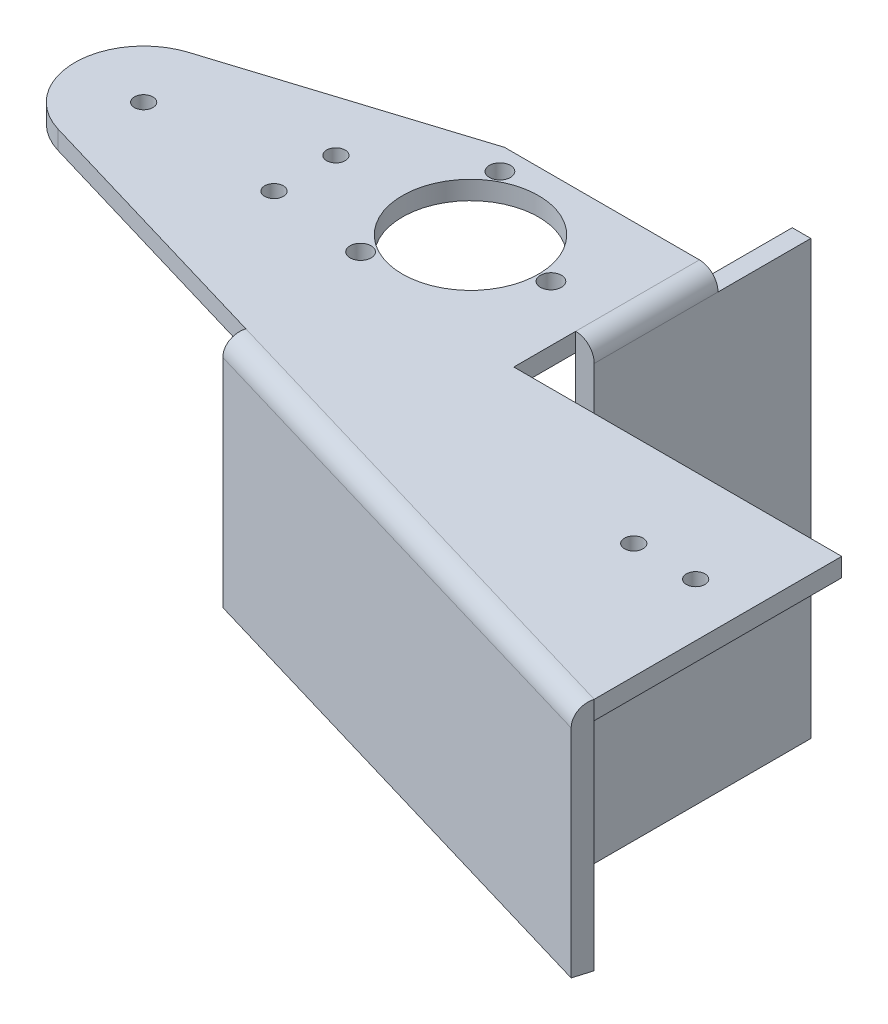
ISO-10303-21;
HEADER;
FILE_DESCRIPTION(('STEP AP214'),'2;1');
FILE_NAME('part.step','',(''),(''),'','','');
FILE_SCHEMA(('AUTOMOTIVE_DESIGN { 1 0 10303 214 1 1 1 1 }'));
ENDSEC;
DATA;
#1=APPLICATION_CONTEXT('core data for automotive mechanical design processes');
#2=APPLICATION_PROTOCOL_DEFINITION('international standard','automotive_design',2000,#1);
#3=PRODUCT_CONTEXT('',#1,'mechanical');
#4=PRODUCT('Part','Part','',(#3));
#5=PRODUCT_RELATED_PRODUCT_CATEGORY('part','',(#4));
#6=PRODUCT_DEFINITION_FORMATION('','',#4);
#7=PRODUCT_DEFINITION_CONTEXT('part definition',#1,'design');
#8=PRODUCT_DEFINITION('design','',#6,#7);
#9=PRODUCT_DEFINITION_SHAPE('','',#8);
#10=(LENGTH_UNIT() NAMED_UNIT(*) SI_UNIT(.MILLI.,.METRE.));
#11=(NAMED_UNIT(*) PLANE_ANGLE_UNIT() SI_UNIT($,.RADIAN.));
#12=(NAMED_UNIT(*) SI_UNIT($,.STERADIAN.) SOLID_ANGLE_UNIT());
#13=UNCERTAINTY_MEASURE_WITH_UNIT(LENGTH_MEASURE(1.E-05),#10,'distance_accuracy_value','');
#14=(GEOMETRIC_REPRESENTATION_CONTEXT(3) GLOBAL_UNCERTAINTY_ASSIGNED_CONTEXT((#13)) GLOBAL_UNIT_ASSIGNED_CONTEXT((#10,
#11,#12)) REPRESENTATION_CONTEXT('',''));
#15=CARTESIAN_POINT('',(0.,0.,0.));
#16=DIRECTION('',(0.,0.,1.));
#17=DIRECTION('',(1.,0.,0.));
#18=AXIS2_PLACEMENT_3D('',#15,#16,#17);
#19=CARTESIAN_POINT('',(-531.814143115865,-3.,33.209876935335));
#20=DIRECTION('',(0.,-1.,0.));
#21=DIRECTION('',(0.,0.,1.));
#22=AXIS2_PLACEMENT_3D('',#19,#20,#21);
#23=PLANE('',#22);
#24=CARTESIAN_POINT('',(-430.455543115792,-3.,55.359876935335));
#25=DIRECTION('',(0.,1.,0.));
#26=DIRECTION('',(0.,0.,1.));
#27=AXIS2_PLACEMENT_3D('',#24,#25,#26);
#28=CIRCLE('',#27,1.49999999998116);
#29=CARTESIAN_POINT('',(-430.455543115792,-3.,56.8598769353162));
#30=VERTEX_POINT('',#29);
#31=EDGE_CURVE('E200',#30,#30,#28,.T.);
#32=ORIENTED_EDGE('',*,*,#31,.T.);
#33=EDGE_LOOP('',(#32));
#34=FACE_BOUND('',#33,.T.);
#35=CARTESIAN_POINT('',(-493.344143115865,-3.,14.1015466861375));
#36=DIRECTION('',(0.,1.,0.));
#37=DIRECTION('',(0.,0.,1.));
#38=AXIS2_PLACEMENT_3D('',#35,#36,#37);
#39=CIRCLE('',#38,1.70000000000349);
#40=CARTESIAN_POINT('',(-493.344143115865,-3.,15.801546686141));
#41=VERTEX_POINT('',#40);
#42=EDGE_CURVE('E213',#41,#41,#39,.T.);
#43=ORIENTED_EDGE('',*,*,#42,.T.);
#44=EDGE_LOOP('',(#43));
#45=FACE_BOUND('',#44,.T.);
#46=CARTESIAN_POINT('',(-473.844143115865,-3.,25.3598769353352));
#47=DIRECTION('',(0.,1.,0.));
#48=DIRECTION('',(0.,0.,1.));
#49=AXIS2_PLACEMENT_3D('',#46,#47,#48);
#50=CIRCLE('',#49,1.70000000000361);
#51=CARTESIAN_POINT('',(-473.844143115865,-3.,27.0598769353388));
#52=VERTEX_POINT('',#51);
#53=EDGE_CURVE('E225',#52,#52,#50,.T.);
#54=ORIENTED_EDGE('',*,*,#53,.T.);
#55=EDGE_LOOP('',(#54));
#56=FACE_BOUND('',#55,.T.);
#57=CARTESIAN_POINT('',(-508.844143115865,-3.,25.113476935338));
#58=DIRECTION('',(0.,1.,0.));
#59=DIRECTION('',(0.,0.,1.));
#60=AXIS2_PLACEMENT_3D('',#57,#58,#59);
#61=CIRCLE('',#60,1.49999999999997);
#62=CARTESIAN_POINT('',(-508.844143115865,-3.,26.613476935338));
#63=VERTEX_POINT('',#62);
#64=EDGE_CURVE('E237',#63,#63,#61,.T.);
#65=ORIENTED_EDGE('',*,*,#64,.T.);
#66=EDGE_LOOP('',(#65));
#67=FACE_BOUND('',#66,.T.);
#68=CARTESIAN_POINT('',(-531.814143115865,-3.,33.209876935335));
#69=DIRECTION('',(0.,1.,0.));
#70=DIRECTION('',(0.,0.,1.));
#71=AXIS2_PLACEMENT_3D('',#68,#69,#70);
#72=CIRCLE('',#71,1.49999999999997);
#73=CARTESIAN_POINT('',(-531.814143115865,-3.,34.709876935335));
#74=VERTEX_POINT('',#73);
#75=EDGE_CURVE('E249',#74,#74,#72,.T.);
#76=ORIENTED_EDGE('',*,*,#75,.T.);
#77=EDGE_LOOP('',(#76));
#78=FACE_BOUND('',#77,.T.);
#79=CARTESIAN_POINT('',(-508.844143115865,-3.,35.113476935338));
#80=DIRECTION('',(0.,1.,0.));
#81=DIRECTION('',(0.,0.,1.));
#82=AXIS2_PLACEMENT_3D('',#79,#80,#81);
#83=CIRCLE('',#82,1.49999999999997);
#84=CARTESIAN_POINT('',(-508.844143115865,-3.,36.613476935338));
#85=VERTEX_POINT('',#84);
#86=EDGE_CURVE('E243',#85,#85,#83,.T.);
#87=ORIENTED_EDGE('',*,*,#86,.T.);
#88=EDGE_LOOP('',(#87));
#89=FACE_BOUND('',#88,.T.);
#90=CARTESIAN_POINT('',(-486.844143115865,-3.,25.359876935335));
#91=DIRECTION('',(0.,1.,0.));
#92=DIRECTION('',(0.,0.,1.));
#93=AXIS2_PLACEMENT_3D('',#90,#91,#92);
#94=CIRCLE('',#93,11.0000000000028);
#95=CARTESIAN_POINT('',(-486.844143115865,-3.,36.3598769353378));
#96=VERTEX_POINT('',#95);
#97=EDGE_CURVE('E231',#96,#96,#94,.T.);
#98=ORIENTED_EDGE('',*,*,#97,.T.);
#99=EDGE_LOOP('',(#98));
#100=FACE_BOUND('',#99,.T.);
#101=CARTESIAN_POINT('',(-493.344143115865,-3.,36.6182071845329));
#102=DIRECTION('',(0.,1.,0.));
#103=DIRECTION('',(0.,0.,1.));
#104=AXIS2_PLACEMENT_3D('',#101,#102,#103);
#105=CIRCLE('',#104,1.70000000000345);
#106=CARTESIAN_POINT('',(-493.344143115865,-3.,38.3182071845364));
#107=VERTEX_POINT('',#106);
#108=EDGE_CURVE('E219',#107,#107,#105,.T.);
#109=ORIENTED_EDGE('',*,*,#108,.T.);
#110=EDGE_LOOP('',(#109));
#111=FACE_BOUND('',#110,.T.);
#112=CARTESIAN_POINT('',(-420.455543115792,-3.,55.359876935335));
#113=DIRECTION('',(0.,1.,0.));
#114=DIRECTION('',(0.,0.,1.));
#115=AXIS2_PLACEMENT_3D('',#112,#113,#114);
#116=CIRCLE('',#115,1.49999999998116);
#117=CARTESIAN_POINT('',(-420.455543115792,-3.,56.8598769353162));
#118=VERTEX_POINT('',#117);
#119=EDGE_CURVE('E207',#118,#118,#116,.T.);
#120=ORIENTED_EDGE('',*,*,#119,.T.);
#121=EDGE_LOOP('',(#120));
#122=FACE_BOUND('',#121,.T.);
#123=DIRECTION('',(0.958808610714418,0.,0.284052896517335));
#124=VECTOR('',#123,1.);
#125=CARTESIAN_POINT('',(-534.975651854103,-3.,43.8814167725865));
#126=LINE('',#125,#124);
#127=CARTESIAN_POINT('',(-534.975651854103,-3.,43.8814167725865));
#128=VERTEX_POINT('',#127);
#129=CARTESIAN_POINT('',(-491.844143115865,-3.,56.6593891972715));
#130=VERTEX_POINT('',#129);
#131=EDGE_CURVE('E258',#128,#130,#126,.T.);
#132=ORIENTED_EDGE('',*,*,#131,.F.);
#133=CARTESIAN_POINT('',(-531.814143115865,-3.,33.209876935335));
#134=DIRECTION('',(0.,1.,0.));
#135=DIRECTION('',(0.,0.,1.));
#136=AXIS2_PLACEMENT_3D('',#133,#134,#135);
#137=CIRCLE('',#136,11.13);
#138=CARTESIAN_POINT('',(-535.160059098475,-3.,22.5947110752404));
#139=VERTEX_POINT('',#138);
#140=EDGE_CURVE('E255',#139,#128,#137,.T.);
#141=ORIENTED_EDGE('',*,*,#140,.F.);
#142=DIRECTION('',(-0.953743563350818,0.,0.300621382085313));
#143=VECTOR('',#142,1.);
#144=CARTESIAN_POINT('',(-496.344143115865,-3.,10.359876935335));
#145=LINE('',#144,#143);
#146=CARTESIAN_POINT('',(-496.344143115865,-3.,10.359876935335));
#147=VERTEX_POINT('',#146);
#148=EDGE_CURVE('E276',#147,#139,#145,.T.);
#149=ORIENTED_EDGE('',*,*,#148,.F.);
#150=DIRECTION('',(-1.,0.,0.));
#151=VECTOR('',#150,1.);
#152=CARTESIAN_POINT('',(-461.844143115865,-3.,10.359876935335));
#153=LINE('',#152,#151);
#154=CARTESIAN_POINT('',(-464.844143115865,-3.,10.359876935335));
#155=VERTEX_POINT('',#154);
#156=EDGE_CURVE('E271',#155,#147,#153,.T.);
#157=ORIENTED_EDGE('',*,*,#156,.F.);
#158=DIRECTION('',(0.,0.,1.));
#159=VECTOR('',#158,1.);
#160=CARTESIAN_POINT('',(-464.844143115865,-2.99999999997697,-4.64012306466499));
#161=LINE('',#160,#159);
#162=CARTESIAN_POINT('',(-464.844143115865,-2.99999999997735,30.359876935335));
#163=VERTEX_POINT('',#162);
#164=EDGE_CURVE('E191',#155,#163,#161,.T.);
#165=ORIENTED_EDGE('',*,*,#164,.T.);
#166=DIRECTION('',(0.,0.,-1.));
#167=VECTOR('',#166,1.);
#168=CARTESIAN_POINT('',(-464.844143115865,-3.,30.359876935335));
#169=LINE('',#168,#167);
#170=CARTESIAN_POINT('',(-464.844143115865,-3.,40.359876935335));
#171=VERTEX_POINT('',#170);
#172=EDGE_CURVE('E268',#171,#163,#169,.T.);
#173=ORIENTED_EDGE('',*,*,#172,.F.);
#174=DIRECTION('',(-1.,0.,0.));
#175=VECTOR('',#174,1.);
#176=CARTESIAN_POINT('',(-464.844143115865,-3.,40.359876935335));
#177=LINE('',#176,#175);
#178=CARTESIAN_POINT('',(-411.844143115865,-3.,40.359876935335));
#179=VERTEX_POINT('',#178);
#180=EDGE_CURVE('E265',#179,#171,#177,.T.);
#181=ORIENTED_EDGE('',*,*,#180,.F.);
#182=DIRECTION('',(0.,0.,-1.));
#183=VECTOR('',#182,1.);
#184=CARTESIAN_POINT('',(-411.844143115865,-3.,40.359876935335));
#185=LINE('',#184,#183);
#186=CARTESIAN_POINT('',(-411.844143115865,-2.9999999999805,80.359876935335));
#187=VERTEX_POINT('',#186);
#188=EDGE_CURVE('E262',#187,#179,#185,.T.);
#189=ORIENTED_EDGE('',*,*,#188,.F.);
#190=DIRECTION('',(-0.958808610714418,0.,-0.284052896517336));
#191=VECTOR('',#190,1.);
#192=CARTESIAN_POINT('',(-491.844143115865,-2.99999999997629,56.6593891972714));
#193=LINE('',#192,#191);
#194=EDGE_CURVE('E161',#187,#130,#193,.T.);
#195=ORIENTED_EDGE('',*,*,#194,.T.);
#196=EDGE_LOOP('',(#132,#141,#149,#157,#165,#173,#181,#189,#195));
#197=FACE_BOUND('',#196,.T.);
#198=ADVANCED_FACE('F30',(#34,#45,#56,#67,#78,#89,#100,#111,#122,#197),#23,.T.);
#199=CARTESIAN_POINT('',(-531.814143115865,0.,33.209876935335));
#200=DIRECTION('',(0.,-1.,0.));
#201=DIRECTION('',(0.,0.,1.));
#202=AXIS2_PLACEMENT_3D('',#199,#200,#201);
#203=PLANE('',#202);
#204=CARTESIAN_POINT('',(-420.455543115792,0.,55.359876935335));
#205=DIRECTION('',(0.,1.,0.));
#206=DIRECTION('',(0.,0.,1.));
#207=AXIS2_PLACEMENT_3D('',#204,#205,#206);
#208=CIRCLE('',#207,1.49999999998116);
#209=CARTESIAN_POINT('',(-420.455543115792,0.,56.8598769353162));
#210=VERTEX_POINT('',#209);
#211=EDGE_CURVE('E203',#210,#210,#208,.T.);
#212=ORIENTED_EDGE('',*,*,#211,.F.);
#213=EDGE_LOOP('',(#212));
#214=FACE_BOUND('',#213,.T.);
#215=CARTESIAN_POINT('',(-493.344143115865,0.,36.6182071845329));
#216=DIRECTION('',(0.,1.,0.));
#217=DIRECTION('',(0.,0.,1.));
#218=AXIS2_PLACEMENT_3D('',#215,#216,#217);
#219=CIRCLE('',#218,1.70000000000345);
#220=CARTESIAN_POINT('',(-493.344143115865,0.,38.3182071845364));
#221=VERTEX_POINT('',#220);
#222=EDGE_CURVE('E216',#221,#221,#219,.T.);
#223=ORIENTED_EDGE('',*,*,#222,.F.);
#224=EDGE_LOOP('',(#223));
#225=FACE_BOUND('',#224,.T.);
#226=CARTESIAN_POINT('',(-486.844143115865,0.,25.359876935335));
#227=DIRECTION('',(0.,1.,0.));
#228=DIRECTION('',(0.,0.,1.));
#229=AXIS2_PLACEMENT_3D('',#226,#227,#228);
#230=CIRCLE('',#229,11.0000000000028);
#231=CARTESIAN_POINT('',(-486.844143115865,0.,36.3598769353378));
#232=VERTEX_POINT('',#231);
#233=EDGE_CURVE('E228',#232,#232,#230,.T.);
#234=ORIENTED_EDGE('',*,*,#233,.F.);
#235=EDGE_LOOP('',(#234));
#236=FACE_BOUND('',#235,.T.);
#237=CARTESIAN_POINT('',(-508.844143115865,0.,35.113476935338));
#238=DIRECTION('',(0.,1.,0.));
#239=DIRECTION('',(0.,0.,1.));
#240=AXIS2_PLACEMENT_3D('',#237,#238,#239);
#241=CIRCLE('',#240,1.49999999999997);
#242=CARTESIAN_POINT('',(-508.844143115865,0.,36.613476935338));
#243=VERTEX_POINT('',#242);
#244=EDGE_CURVE('E240',#243,#243,#241,.T.);
#245=ORIENTED_EDGE('',*,*,#244,.F.);
#246=EDGE_LOOP('',(#245));
#247=FACE_BOUND('',#246,.T.);
#248=DIRECTION('',(-1.,0.,0.));
#249=VECTOR('',#248,1.);
#250=CARTESIAN_POINT('',(-461.844143115865,0.,10.359876935335));
#251=LINE('',#250,#249);
#252=CARTESIAN_POINT('',(-464.844143115865,0.,10.359876935335));
#253=VERTEX_POINT('',#252);
#254=CARTESIAN_POINT('',(-496.344143115865,0.,10.359876935335));
#255=VERTEX_POINT('',#254);
#256=EDGE_CURVE('E337',#253,#255,#251,.T.);
#257=ORIENTED_EDGE('',*,*,#256,.T.);
#258=DIRECTION('',(-0.953743563350818,0.,0.300621382085313));
#259=VECTOR('',#258,1.);
#260=CARTESIAN_POINT('',(-496.344143115865,0.,10.359876935335));
#261=LINE('',#260,#259);
#262=CARTESIAN_POINT('',(-535.160059098475,0.,22.5947110752404));
#263=VERTEX_POINT('',#262);
#264=EDGE_CURVE('E259',#255,#263,#261,.T.);
#265=ORIENTED_EDGE('',*,*,#264,.T.);
#266=CARTESIAN_POINT('',(-531.814143115865,0.,33.209876935335));
#267=DIRECTION('',(0.,1.,0.));
#268=DIRECTION('',(0.,0.,1.));
#269=AXIS2_PLACEMENT_3D('',#266,#267,#268);
#270=CIRCLE('',#269,11.13);
#271=CARTESIAN_POINT('',(-534.975651854103,0.,43.8814167725865));
#272=VERTEX_POINT('',#271);
#273=EDGE_CURVE('E252',#263,#272,#270,.T.);
#274=ORIENTED_EDGE('',*,*,#273,.T.);
#275=DIRECTION('',(0.958808610714418,0.,0.284052896517335));
#276=VECTOR('',#275,1.);
#277=CARTESIAN_POINT('',(-534.975651854103,0.,43.8814167725865));
#278=LINE('',#277,#276);
#279=CARTESIAN_POINT('',(-491.844143115865,0.,56.6593891972715));
#280=VERTEX_POINT('',#279);
#281=EDGE_CURVE('E320',#272,#280,#278,.T.);
#282=ORIENTED_EDGE('',*,*,#281,.T.);
#283=DIRECTION('',(0.958808610714418,0.,0.284052896517336));
#284=VECTOR('',#283,1.);
#285=CARTESIAN_POINT('',(-534.975651854103,0.,43.8814167725865));
#286=LINE('',#285,#284);
#287=CARTESIAN_POINT('',(-411.844143115865,0.,80.359876935335));
#288=VERTEX_POINT('',#287);
#289=EDGE_CURVE('E291',#288,#280,#286,.F.);
#290=ORIENTED_EDGE('',*,*,#289,.F.);
#291=DIRECTION('',(0.,0.,-1.));
#292=VECTOR('',#291,1.);
#293=CARTESIAN_POINT('',(-411.844143115865,0.,40.359876935335));
#294=LINE('',#293,#292);
#295=CARTESIAN_POINT('',(-411.844143115865,0.,40.359876935335));
#296=VERTEX_POINT('',#295);
#297=EDGE_CURVE('E314',#288,#296,#294,.T.);
#298=ORIENTED_EDGE('',*,*,#297,.T.);
#299=DIRECTION('',(-1.,0.,0.));
#300=VECTOR('',#299,1.);
#301=CARTESIAN_POINT('',(-464.844143115865,0.,40.359876935335));
#302=LINE('',#301,#300);
#303=CARTESIAN_POINT('',(-464.844143115865,0.,40.359876935335));
#304=VERTEX_POINT('',#303);
#305=EDGE_CURVE('E319',#296,#304,#302,.T.);
#306=ORIENTED_EDGE('',*,*,#305,.T.);
#307=DIRECTION('',(0.,0.,-1.));
#308=VECTOR('',#307,1.);
#309=CARTESIAN_POINT('',(-464.844143115865,0.,30.359876935335));
#310=LINE('',#309,#308);
#311=CARTESIAN_POINT('',(-464.844143115865,0.,30.359876935335));
#312=VERTEX_POINT('',#311);
#313=EDGE_CURVE('E334',#304,#312,#310,.T.);
#314=ORIENTED_EDGE('',*,*,#313,.T.);
#315=DIRECTION('',(0.,0.,-1.));
#316=VECTOR('',#315,1.);
#317=CARTESIAN_POINT('',(-464.844143115865,0.,33.209876935335));
#318=LINE('',#317,#316);
#319=EDGE_CURVE('E296',#253,#312,#318,.F.);
#320=ORIENTED_EDGE('',*,*,#319,.F.);
#321=EDGE_LOOP('',(#257,#265,#274,#282,#290,#298,#306,#314,#320));
#322=FACE_BOUND('',#321,.T.);
#323=CARTESIAN_POINT('',(-531.814143115865,0.,33.209876935335));
#324=DIRECTION('',(0.,1.,0.));
#325=DIRECTION('',(0.,0.,1.));
#326=AXIS2_PLACEMENT_3D('',#323,#324,#325);
#327=CIRCLE('',#326,1.49999999999997);
#328=CARTESIAN_POINT('',(-531.814143115865,0.,34.709876935335));
#329=VERTEX_POINT('',#328);
#330=EDGE_CURVE('E246',#329,#329,#327,.T.);
#331=ORIENTED_EDGE('',*,*,#330,.F.);
#332=EDGE_LOOP('',(#331));
#333=FACE_BOUND('',#332,.T.);
#334=CARTESIAN_POINT('',(-508.844143115865,0.,25.113476935338));
#335=DIRECTION('',(0.,1.,0.));
#336=DIRECTION('',(0.,0.,1.));
#337=AXIS2_PLACEMENT_3D('',#334,#335,#336);
#338=CIRCLE('',#337,1.49999999999997);
#339=CARTESIAN_POINT('',(-508.844143115865,0.,26.613476935338));
#340=VERTEX_POINT('',#339);
#341=EDGE_CURVE('E234',#340,#340,#338,.T.);
#342=ORIENTED_EDGE('',*,*,#341,.F.);
#343=EDGE_LOOP('',(#342));
#344=FACE_BOUND('',#343,.T.);
#345=CARTESIAN_POINT('',(-473.844143115865,0.,25.3598769353352));
#346=DIRECTION('',(0.,1.,0.));
#347=DIRECTION('',(0.,0.,1.));
#348=AXIS2_PLACEMENT_3D('',#345,#346,#347);
#349=CIRCLE('',#348,1.70000000000361);
#350=CARTESIAN_POINT('',(-473.844143115865,0.,27.0598769353388));
#351=VERTEX_POINT('',#350);
#352=EDGE_CURVE('E222',#351,#351,#349,.T.);
#353=ORIENTED_EDGE('',*,*,#352,.F.);
#354=EDGE_LOOP('',(#353));
#355=FACE_BOUND('',#354,.T.);
#356=CARTESIAN_POINT('',(-493.344143115865,0.,14.1015466861375));
#357=DIRECTION('',(0.,1.,0.));
#358=DIRECTION('',(0.,0.,1.));
#359=AXIS2_PLACEMENT_3D('',#356,#357,#358);
#360=CIRCLE('',#359,1.70000000000349);
#361=CARTESIAN_POINT('',(-493.344143115865,0.,15.801546686141));
#362=VERTEX_POINT('',#361);
#363=EDGE_CURVE('E210',#362,#362,#360,.T.);
#364=ORIENTED_EDGE('',*,*,#363,.F.);
#365=EDGE_LOOP('',(#364));
#366=FACE_BOUND('',#365,.T.);
#367=CARTESIAN_POINT('',(-430.455543115792,0.,55.359876935335));
#368=DIRECTION('',(0.,1.,0.));
#369=DIRECTION('',(0.,0.,1.));
#370=AXIS2_PLACEMENT_3D('',#367,#368,#369);
#371=CIRCLE('',#370,1.49999999998116);
#372=CARTESIAN_POINT('',(-430.455543115792,0.,56.8598769353162));
#373=VERTEX_POINT('',#372);
#374=EDGE_CURVE('E204',#373,#373,#371,.T.);
#375=ORIENTED_EDGE('',*,*,#374,.F.);
#376=EDGE_LOOP('',(#375));
#377=FACE_BOUND('',#376,.T.);
#378=ADVANCED_FACE('F323',(#214,#225,#236,#247,#322,#333,#344,#355,#366,#377),#203,.F.);
#379=CARTESIAN_POINT('',(-531.814143115865,-3.,33.209876935335));
#380=DIRECTION('',(0.,1.,0.));
#381=DIRECTION('',(0.,0.,-1.));
#382=AXIS2_PLACEMENT_3D('',#379,#380,#381);
#383=CYLINDRICAL_SURFACE('',#382,11.13);
#384=ORIENTED_EDGE('',*,*,#273,.F.);
#385=DIRECTION('',(0.,1.,0.));
#386=VECTOR('',#385,1.);
#387=CARTESIAN_POINT('',(-535.160059098475,-3.,22.5947110752404));
#388=LINE('',#387,#386);
#389=EDGE_CURVE('E340',#139,#263,#388,.T.);
#390=ORIENTED_EDGE('',*,*,#389,.F.);
#391=ORIENTED_EDGE('',*,*,#140,.T.);
#392=DIRECTION('',(0.,1.,0.));
#393=VECTOR('',#392,1.);
#394=CARTESIAN_POINT('',(-534.975651854103,-3.,43.8814167725865));
#395=LINE('',#394,#393);
#396=EDGE_CURVE('E282',#128,#272,#395,.T.);
#397=ORIENTED_EDGE('',*,*,#396,.T.);
#398=EDGE_LOOP('',(#384,#390,#391,#397));
#399=FACE_BOUND('',#398,.T.);
#400=ADVANCED_FACE('F381',(#399),#383,.T.);
#401=CARTESIAN_POINT('',(-534.975651854103,-3.,43.8814167725865));
#402=DIRECTION('',(0.284052896517335,0.,-0.958808610714418));
#403=DIRECTION('',(0.958808610714418,0.,0.284052896517335));
#404=AXIS2_PLACEMENT_3D('',#401,#402,#403);
#405=PLANE('',#404);
#406=ORIENTED_EDGE('',*,*,#281,.F.);
#407=ORIENTED_EDGE('',*,*,#396,.F.);
#408=ORIENTED_EDGE('',*,*,#131,.T.);
#409=DIRECTION('',(0.,1.,0.));
#410=VECTOR('',#409,1.);
#411=CARTESIAN_POINT('',(-491.844143115865,-3.,56.6593891972715));
#412=LINE('',#411,#410);
#413=EDGE_CURVE('E155',#130,#280,#412,.T.);
#414=ORIENTED_EDGE('',*,*,#413,.T.);
#415=EDGE_LOOP('',(#406,#407,#408,#414));
#416=FACE_BOUND('',#415,.T.);
#417=ADVANCED_FACE('F380',(#416),#405,.F.);
#418=CARTESIAN_POINT('',(-491.844143115865,-3.,56.6593891972715));
#419=DIRECTION('',(0.958808610714385,0.,0.284052896517447));
#420=DIRECTION('',(-0.284052896517447,0.,0.958808610714385));
#421=AXIS2_PLACEMENT_3D('',#418,#419,#420);
#422=PLANE('',#421);
#423=ORIENTED_EDGE('',*,*,#413,.F.);
#424=DIRECTION('',(0.,1.,0.));
#425=VECTOR('',#424,1.);
#426=CARTESIAN_POINT('',(-491.844143115867,-37.9999999999763,56.6593891972711));
#427=LINE('',#426,#425);
#428=CARTESIAN_POINT('',(-491.844143115867,-37.9999999999763,56.6593891972711));
#429=VERTEX_POINT('',#428);
#430=EDGE_CURVE('E160',#429,#130,#427,.T.);
#431=ORIENTED_EDGE('',*,*,#430,.F.);
#432=DIRECTION('',(-0.284052896517339,0.,0.958808610714417));
#433=VECTOR('',#432,1.);
#434=CARTESIAN_POINT('',(-492.696301805419,-37.9999999999763,59.5358150294143));
#435=LINE('',#434,#433);
#436=CARTESIAN_POINT('',(-492.696301805419,-37.9999999999763,59.5358150294143));
#437=VERTEX_POINT('',#436);
#438=EDGE_CURVE('E146',#429,#437,#435,.T.);
#439=ORIENTED_EDGE('',*,*,#438,.T.);
#440=DIRECTION('',(0.,1.,0.));
#441=VECTOR('',#440,1.);
#442=CARTESIAN_POINT('',(-492.696301805417,-3.,59.5358150294147));
#443=LINE('',#442,#441);
#444=CARTESIAN_POINT('',(-492.696301805417,-3.,59.5358150294147));
#445=VERTEX_POINT('',#444);
#446=EDGE_CURVE('E152',#437,#445,#443,.T.);
#447=ORIENTED_EDGE('',*,*,#446,.T.);
#448=CARTESIAN_POINT('',(-491.844143115865,-3.,56.6593891972715));
#449=DIRECTION('',(-0.958808610714385,0.,-0.284052896517447));
#450=DIRECTION('',(-0.284052896517447,0.,0.958808610714385));
#451=AXIS2_PLACEMENT_3D('',#448,#449,#450);
#452=CIRCLE('',#451,3.);
#453=EDGE_CURVE('E11',#280,#445,#452,.F.);
#454=ORIENTED_EDGE('',*,*,#453,.F.);
#455=EDGE_LOOP('',(#423,#431,#439,#447,#454));
#456=FACE_BOUND('',#455,.T.);
#457=ADVANCED_FACE('F159',(#456),#422,.F.);
#458=CARTESIAN_POINT('',(-492.696301805417,-3.,59.5358150294147));
#459=DIRECTION('',(0.284052896517336,0.,-0.958808610714418));
#460=DIRECTION('',(0.958808610714418,0.,0.284052896517336));
#461=AXIS2_PLACEMENT_3D('',#458,#459,#460);
#462=PLANE('',#461);
#463=ORIENTED_EDGE('',*,*,#446,.F.);
#464=DIRECTION('',(0.958808610714418,0.,0.284052896517336));
#465=VECTOR('',#464,1.);
#466=CARTESIAN_POINT('',(-492.696301805419,-37.9999999999763,59.5358150294143));
#467=LINE('',#466,#465);
#468=CARTESIAN_POINT('',(-412.696301805419,-37.9999999999805,83.2363027674779));
#469=VERTEX_POINT('',#468);
#470=EDGE_CURVE('E143',#437,#469,#467,.T.);
#471=ORIENTED_EDGE('',*,*,#470,.T.);
#472=DIRECTION('',(0.,1.,0.));
#473=VECTOR('',#472,1.);
#474=CARTESIAN_POINT('',(-412.696301805417,-3.,83.2363027674783));
#475=LINE('',#474,#473);
#476=CARTESIAN_POINT('',(-412.696301805417,-3.,83.2363027674783));
#477=VERTEX_POINT('',#476);
#478=EDGE_CURVE('E156',#469,#477,#475,.T.);
#479=ORIENTED_EDGE('',*,*,#478,.T.);
#480=DIRECTION('',(0.958808610714418,0.,0.284052896517336));
#481=VECTOR('',#480,1.);
#482=CARTESIAN_POINT('',(-492.696301805417,-3.,59.5358150294147));
#483=LINE('',#482,#481);
#484=EDGE_CURVE('E45',#445,#477,#483,.T.);
#485=ORIENTED_EDGE('',*,*,#484,.F.);
#486=EDGE_LOOP('',(#463,#471,#479,#485));
#487=FACE_BOUND('',#486,.T.);
#488=ADVANCED_FACE('F153',(#487),#462,.F.);
#489=CARTESIAN_POINT('',(-412.696301805417,-3.,83.2363027674783));
#490=DIRECTION('',(-0.958808610714411,0.,-0.284052896517357));
#491=DIRECTION('',(0.284052896517357,0.,-0.958808610714411));
#492=AXIS2_PLACEMENT_3D('',#489,#490,#491);
#493=PLANE('',#492);
#494=ORIENTED_EDGE('',*,*,#478,.F.);
#495=DIRECTION('',(0.284052896517339,0.,-0.958808610714417));
#496=VECTOR('',#495,1.);
#497=CARTESIAN_POINT('',(-412.696301805419,-37.9999999999805,83.2363027674779));
#498=LINE('',#497,#496);
#499=CARTESIAN_POINT('',(-411.844143115867,-37.9999999999805,80.3598769353346));
#500=VERTEX_POINT('',#499);
#501=EDGE_CURVE('E149',#469,#500,#498,.T.);
#502=ORIENTED_EDGE('',*,*,#501,.T.);
#503=DIRECTION('',(0.,1.,0.));
#504=VECTOR('',#503,1.);
#505=CARTESIAN_POINT('',(-411.844143115867,-37.9999999999805,80.3598769353346));
#506=LINE('',#505,#504);
#507=EDGE_CURVE('E170',#500,#187,#506,.T.);
#508=ORIENTED_EDGE('',*,*,#507,.T.);
#509=DIRECTION('',(0.,1.,0.));
#510=VECTOR('',#509,1.);
#511=CARTESIAN_POINT('',(-411.844143115865,-3.,80.359876935335));
#512=LINE('',#511,#510);
#513=EDGE_CURVE('E305',#187,#288,#512,.T.);
#514=ORIENTED_EDGE('',*,*,#513,.T.);
#515=CARTESIAN_POINT('',(-411.844143115865,-3.,80.359876935335));
#516=DIRECTION('',(0.958808610714411,0.,0.284052896517357));
#517=DIRECTION('',(0.284052896517357,0.,-0.958808610714411));
#518=AXIS2_PLACEMENT_3D('',#515,#516,#517);
#519=CIRCLE('',#518,3.);
#520=EDGE_CURVE('E38',#477,#288,#519,.F.);
#521=ORIENTED_EDGE('',*,*,#520,.F.);
#522=EDGE_LOOP('',(#494,#502,#508,#514,#521));
#523=FACE_BOUND('',#522,.T.);
#524=ADVANCED_FACE('F307',(#523),#493,.F.);
#525=CARTESIAN_POINT('',(-411.844143115865,-3.,40.359876935335));
#526=DIRECTION('',(-1.,0.,0.));
#527=DIRECTION('',(0.,0.,-1.));
#528=AXIS2_PLACEMENT_3D('',#525,#526,#527);
#529=PLANE('',#528);
#530=ORIENTED_EDGE('',*,*,#297,.F.);
#531=ORIENTED_EDGE('',*,*,#513,.F.);
#532=ORIENTED_EDGE('',*,*,#188,.T.);
#533=DIRECTION('',(0.,1.,0.));
#534=VECTOR('',#533,1.);
#535=CARTESIAN_POINT('',(-411.844143115865,-3.,40.359876935335));
#536=LINE('',#535,#534);
#537=EDGE_CURVE('E311',#179,#296,#536,.T.);
#538=ORIENTED_EDGE('',*,*,#537,.T.);
#539=EDGE_LOOP('',(#530,#531,#532,#538));
#540=FACE_BOUND('',#539,.T.);
#541=ADVANCED_FACE('F315',(#540),#529,.F.);
#542=CARTESIAN_POINT('',(-464.844143115865,-3.,40.359876935335));
#543=DIRECTION('',(0.,0.,1.));
#544=DIRECTION('',(-1.,0.,0.));
#545=AXIS2_PLACEMENT_3D('',#542,#543,#544);
#546=PLANE('',#545);
#547=ORIENTED_EDGE('',*,*,#305,.F.);
#548=ORIENTED_EDGE('',*,*,#537,.F.);
#549=ORIENTED_EDGE('',*,*,#180,.T.);
#550=DIRECTION('',(0.,1.,0.));
#551=VECTOR('',#550,1.);
#552=CARTESIAN_POINT('',(-464.844143115865,-3.,40.359876935335));
#553=LINE('',#552,#551);
#554=EDGE_CURVE('E350',#171,#304,#553,.T.);
#555=ORIENTED_EDGE('',*,*,#554,.T.);
#556=EDGE_LOOP('',(#547,#548,#549,#555));
#557=FACE_BOUND('',#556,.T.);
#558=ADVANCED_FACE('F376',(#557),#546,.F.);
#559=CARTESIAN_POINT('',(-464.844143115865,-3.,30.359876935335));
#560=DIRECTION('',(-1.,0.,0.));
#561=DIRECTION('',(0.,0.,-1.));
#562=AXIS2_PLACEMENT_3D('',#559,#560,#561);
#563=PLANE('',#562);
#564=ORIENTED_EDGE('',*,*,#313,.F.);
#565=ORIENTED_EDGE('',*,*,#554,.F.);
#566=ORIENTED_EDGE('',*,*,#172,.T.);
#567=DIRECTION('',(0.,1.,0.));
#568=VECTOR('',#567,1.);
#569=CARTESIAN_POINT('',(-464.844143115865,-3.,30.359876935335));
#570=LINE('',#569,#568);
#571=EDGE_CURVE('E347',#163,#312,#570,.T.);
#572=ORIENTED_EDGE('',*,*,#571,.T.);
#573=EDGE_LOOP('',(#564,#565,#566,#572));
#574=FACE_BOUND('',#573,.T.);
#575=ADVANCED_FACE('F374',(#574),#563,.F.);
#576=CARTESIAN_POINT('',(-464.844143115865,-3.,30.359876935335));
#577=DIRECTION('',(0.,0.,-1.));
#578=DIRECTION('',(1.,0.,0.));
#579=AXIS2_PLACEMENT_3D('',#576,#577,#578);
#580=PLANE('',#579);
#581=ORIENTED_EDGE('',*,*,#571,.F.);
#582=DIRECTION('',(0.,1.,0.));
#583=VECTOR('',#582,1.);
#584=CARTESIAN_POINT('',(-464.844143115869,-72.9999999999773,30.3598769353343));
#585=LINE('',#584,#583);
#586=CARTESIAN_POINT('',(-464.844143115869,-72.9999999999773,30.3598769353343));
#587=VERTEX_POINT('',#586);
#588=EDGE_CURVE('E367',#587,#163,#585,.T.);
#589=ORIENTED_EDGE('',*,*,#588,.F.);
#590=DIRECTION('',(1.,0.,0.));
#591=VECTOR('',#590,1.);
#592=CARTESIAN_POINT('',(-464.844143115869,-72.9999999999773,30.3598769353343));
#593=LINE('',#592,#591);
#594=CARTESIAN_POINT('',(-461.844143115869,-72.9999999999775,30.3598769353343));
#595=VERTEX_POINT('',#594);
#596=EDGE_CURVE('E180',#587,#595,#593,.T.);
#597=ORIENTED_EDGE('',*,*,#596,.T.);
#598=DIRECTION('',(0.,1.,0.));
#599=VECTOR('',#598,1.);
#600=CARTESIAN_POINT('',(-461.844143115865,-3.,30.359876935335));
#601=LINE('',#600,#599);
#602=CARTESIAN_POINT('',(-461.844143115865,-3.,30.359876935335));
#603=VERTEX_POINT('',#602);
#604=EDGE_CURVE('E344',#595,#603,#601,.T.);
#605=ORIENTED_EDGE('',*,*,#604,.T.);
#606=CARTESIAN_POINT('',(-464.844143115865,-3.,30.359876935335));
#607=DIRECTION('',(0.,0.,1.));
#608=DIRECTION('',(1.,0.,0.));
#609=AXIS2_PLACEMENT_3D('',#606,#607,#608);
#610=CIRCLE('',#609,3.);
#611=EDGE_CURVE('E299',#312,#603,#610,.F.);
#612=ORIENTED_EDGE('',*,*,#611,.F.);
#613=EDGE_LOOP('',(#581,#589,#597,#605,#612));
#614=FACE_BOUND('',#613,.T.);
#615=ADVANCED_FACE('F371',(#614),#580,.F.);
#616=CARTESIAN_POINT('',(-461.844143115865,-3.,30.359876935335));
#617=DIRECTION('',(-1.,0.,0.));
#618=DIRECTION('',(0.,0.,-1.));
#619=AXIS2_PLACEMENT_3D('',#616,#617,#618);
#620=PLANE('',#619);
#621=ORIENTED_EDGE('',*,*,#604,.F.);
#622=DIRECTION('',(0.,0.,-1.));
#623=VECTOR('',#622,1.);
#624=CARTESIAN_POINT('',(-461.844143115869,-72.9999999999775,30.3598769353343));
#625=LINE('',#624,#623);
#626=CARTESIAN_POINT('',(-461.844143115869,-72.9999999999771,-4.64012306466574));
#627=VERTEX_POINT('',#626);
#628=EDGE_CURVE('E183',#595,#627,#625,.T.);
#629=ORIENTED_EDGE('',*,*,#628,.T.);
#630=DIRECTION('',(0.,1.,0.));
#631=VECTOR('',#630,1.);
#632=CARTESIAN_POINT('',(-461.844143115869,-72.9999999999771,-4.64012306466574));
#633=LINE('',#632,#631);
#634=CARTESIAN_POINT('',(-461.844143115865,-2.99999999997712,-4.64012306466499));
#635=VERTEX_POINT('',#634);
#636=EDGE_CURVE('E186',#627,#635,#633,.T.);
#637=ORIENTED_EDGE('',*,*,#636,.T.);
#638=DIRECTION('',(0.,0.,-1.));
#639=VECTOR('',#638,1.);
#640=CARTESIAN_POINT('',(-461.844143115865,-2.99999999997749,30.359876935335));
#641=LINE('',#640,#639);
#642=CARTESIAN_POINT('',(-461.844143115865,-3.,10.359876935335));
#643=VERTEX_POINT('',#642);
#644=EDGE_CURVE('E178',#643,#635,#641,.T.);
#645=ORIENTED_EDGE('',*,*,#644,.F.);
#646=DIRECTION('',(0.,0.,-1.));
#647=VECTOR('',#646,1.);
#648=CARTESIAN_POINT('',(-461.844143115865,-3.,30.359876935335));
#649=LINE('',#648,#647);
#650=EDGE_CURVE('E284',#603,#643,#649,.T.);
#651=ORIENTED_EDGE('',*,*,#650,.F.);
#652=EDGE_LOOP('',(#621,#629,#637,#645,#651));
#653=FACE_BOUND('',#652,.T.);
#654=ADVANCED_FACE('F399',(#653),#620,.F.);
#655=CARTESIAN_POINT('',(-461.844143115865,-3.,10.359876935335));
#656=DIRECTION('',(0.,0.,1.));
#657=DIRECTION('',(-1.,0.,0.));
#658=AXIS2_PLACEMENT_3D('',#655,#656,#657);
#659=PLANE('',#658);
#660=EDGE_CURVE('E275',#643,#155,#153,.T.);
#661=ORIENTED_EDGE('',*,*,#660,.T.);
#662=ORIENTED_EDGE('',*,*,#156,.T.);
#663=DIRECTION('',(0.,1.,0.));
#664=VECTOR('',#663,1.);
#665=CARTESIAN_POINT('',(-496.344143115865,-3.,10.359876935335));
#666=LINE('',#665,#664);
#667=EDGE_CURVE('E342',#147,#255,#666,.T.);
#668=ORIENTED_EDGE('',*,*,#667,.T.);
#669=ORIENTED_EDGE('',*,*,#256,.F.);
#670=CARTESIAN_POINT('',(-464.844143115865,-3.,10.359876935335));
#671=DIRECTION('',(0.,0.,-1.));
#672=DIRECTION('',(-1.,0.,0.));
#673=AXIS2_PLACEMENT_3D('',#670,#671,#672);
#674=CIRCLE('',#673,3.);
#675=EDGE_CURVE('E287',#643,#253,#674,.F.);
#676=ORIENTED_EDGE('',*,*,#675,.F.);
#677=EDGE_LOOP('',(#661,#662,#668,#669,#676));
#678=FACE_BOUND('',#677,.T.);
#679=ADVANCED_FACE('F388',(#678),#659,.F.);
#680=CARTESIAN_POINT('',(-496.344143115865,-3.,10.359876935335));
#681=DIRECTION('',(0.300621382085313,0.,0.953743563350818));
#682=DIRECTION('',(-0.953743563350818,0.,0.300621382085313));
#683=AXIS2_PLACEMENT_3D('',#680,#681,#682);
#684=PLANE('',#683);
#685=ORIENTED_EDGE('',*,*,#264,.F.);
#686=ORIENTED_EDGE('',*,*,#667,.F.);
#687=ORIENTED_EDGE('',*,*,#148,.T.);
#688=ORIENTED_EDGE('',*,*,#389,.T.);
#689=EDGE_LOOP('',(#685,#686,#687,#688));
#690=FACE_BOUND('',#689,.T.);
#691=ADVANCED_FACE('F385',(#690),#684,.F.);
#692=CARTESIAN_POINT('',(-531.814143115865,-3.,33.209876935335));
#693=DIRECTION('',(0.,1.,0.));
#694=DIRECTION('',(0.,0.,-1.));
#695=AXIS2_PLACEMENT_3D('',#692,#693,#694);
#696=CYLINDRICAL_SURFACE('',#695,1.49999999999997);
#697=ORIENTED_EDGE('',*,*,#75,.F.);
#698=EDGE_LOOP('',(#697));
#699=FACE_BOUND('',#698,.T.);
#700=ORIENTED_EDGE('',*,*,#330,.T.);
#701=EDGE_LOOP('',(#700));
#702=FACE_BOUND('',#701,.T.);
#703=ADVANCED_FACE('F425',(#699,#702),#696,.F.);
#704=CARTESIAN_POINT('',(-508.844143115865,-3.,35.113476935338));
#705=DIRECTION('',(0.,1.,0.));
#706=DIRECTION('',(0.,0.,-1.));
#707=AXIS2_PLACEMENT_3D('',#704,#705,#706);
#708=CYLINDRICAL_SURFACE('',#707,1.49999999999997);
#709=ORIENTED_EDGE('',*,*,#86,.F.);
#710=EDGE_LOOP('',(#709));
#711=FACE_BOUND('',#710,.T.);
#712=ORIENTED_EDGE('',*,*,#244,.T.);
#713=EDGE_LOOP('',(#712));
#714=FACE_BOUND('',#713,.T.);
#715=ADVANCED_FACE('F558',(#711,#714),#708,.F.);
#716=CARTESIAN_POINT('',(-508.844143115865,-3.,25.113476935338));
#717=DIRECTION('',(0.,1.,0.));
#718=DIRECTION('',(0.,0.,-1.));
#719=AXIS2_PLACEMENT_3D('',#716,#717,#718);
#720=CYLINDRICAL_SURFACE('',#719,1.49999999999997);
#721=ORIENTED_EDGE('',*,*,#64,.F.);
#722=EDGE_LOOP('',(#721));
#723=FACE_BOUND('',#722,.T.);
#724=ORIENTED_EDGE('',*,*,#341,.T.);
#725=EDGE_LOOP('',(#724));
#726=FACE_BOUND('',#725,.T.);
#727=ADVANCED_FACE('F548',(#723,#726),#720,.F.);
#728=CARTESIAN_POINT('',(-486.844143115865,-3.,25.359876935335));
#729=DIRECTION('',(0.,1.,0.));
#730=DIRECTION('',(0.,0.,-1.));
#731=AXIS2_PLACEMENT_3D('',#728,#729,#730);
#732=CYLINDRICAL_SURFACE('',#731,11.0000000000028);
#733=ORIENTED_EDGE('',*,*,#97,.F.);
#734=EDGE_LOOP('',(#733));
#735=FACE_BOUND('',#734,.T.);
#736=ORIENTED_EDGE('',*,*,#233,.T.);
#737=EDGE_LOOP('',(#736));
#738=FACE_BOUND('',#737,.T.);
#739=ADVANCED_FACE('F538',(#735,#738),#732,.F.);
#740=CARTESIAN_POINT('',(-473.844143115865,-3.,25.3598769353352));
#741=DIRECTION('',(0.,1.,0.));
#742=DIRECTION('',(0.,0.,-1.));
#743=AXIS2_PLACEMENT_3D('',#740,#741,#742);
#744=CYLINDRICAL_SURFACE('',#743,1.70000000000361);
#745=ORIENTED_EDGE('',*,*,#53,.F.);
#746=EDGE_LOOP('',(#745));
#747=FACE_BOUND('',#746,.T.);
#748=ORIENTED_EDGE('',*,*,#352,.T.);
#749=EDGE_LOOP('',(#748));
#750=FACE_BOUND('',#749,.T.);
#751=ADVANCED_FACE('F528',(#747,#750),#744,.F.);
#752=CARTESIAN_POINT('',(-493.344143115865,-3.,36.6182071845329));
#753=DIRECTION('',(0.,1.,0.));
#754=DIRECTION('',(0.,0.,-1.));
#755=AXIS2_PLACEMENT_3D('',#752,#753,#754);
#756=CYLINDRICAL_SURFACE('',#755,1.70000000000345);
#757=ORIENTED_EDGE('',*,*,#108,.F.);
#758=EDGE_LOOP('',(#757));
#759=FACE_BOUND('',#758,.T.);
#760=ORIENTED_EDGE('',*,*,#222,.T.);
#761=EDGE_LOOP('',(#760));
#762=FACE_BOUND('',#761,.T.);
#763=ADVANCED_FACE('F518',(#759,#762),#756,.F.);
#764=CARTESIAN_POINT('',(-493.344143115865,-3.,14.1015466861375));
#765=DIRECTION('',(0.,1.,0.));
#766=DIRECTION('',(0.,0.,-1.));
#767=AXIS2_PLACEMENT_3D('',#764,#765,#766);
#768=CYLINDRICAL_SURFACE('',#767,1.70000000000349);
#769=ORIENTED_EDGE('',*,*,#42,.F.);
#770=EDGE_LOOP('',(#769));
#771=FACE_BOUND('',#770,.T.);
#772=ORIENTED_EDGE('',*,*,#363,.T.);
#773=EDGE_LOOP('',(#772));
#774=FACE_BOUND('',#773,.T.);
#775=ADVANCED_FACE('F508',(#771,#774),#768,.F.);
#776=CARTESIAN_POINT('',(-420.455543115792,-3.,55.359876935335));
#777=DIRECTION('',(0.,1.,0.));
#778=DIRECTION('',(0.,0.,-1.));
#779=AXIS2_PLACEMENT_3D('',#776,#777,#778);
#780=CYLINDRICAL_SURFACE('',#779,1.49999999998116);
#781=ORIENTED_EDGE('',*,*,#119,.F.);
#782=EDGE_LOOP('',(#781));
#783=FACE_BOUND('',#782,.T.);
#784=ORIENTED_EDGE('',*,*,#211,.T.);
#785=EDGE_LOOP('',(#784));
#786=FACE_BOUND('',#785,.T.);
#787=ADVANCED_FACE('F498',(#783,#786),#780,.F.);
#788=CARTESIAN_POINT('',(-430.455543115792,-3.,55.359876935335));
#789=DIRECTION('',(0.,1.,0.));
#790=DIRECTION('',(0.,0.,-1.));
#791=AXIS2_PLACEMENT_3D('',#788,#789,#790);
#792=CYLINDRICAL_SURFACE('',#791,1.49999999998116);
#793=ORIENTED_EDGE('',*,*,#31,.F.);
#794=EDGE_LOOP('',(#793));
#795=FACE_BOUND('',#794,.T.);
#796=ORIENTED_EDGE('',*,*,#374,.T.);
#797=EDGE_LOOP('',(#796));
#798=FACE_BOUND('',#797,.T.);
#799=ADVANCED_FACE('F490',(#795,#798),#792,.F.);
#800=CARTESIAN_POINT('',(-464.844143115865,-2.99999999997697,-4.64012306466499));
#801=DIRECTION('',(0.,-1.,0.));
#802=DIRECTION('',(1.,0.,0.));
#803=AXIS2_PLACEMENT_3D('',#800,#801,#802);
#804=PLANE('',#803);
#805=ORIENTED_EDGE('',*,*,#644,.T.);
#806=DIRECTION('',(-1.,0.,0.));
#807=VECTOR('',#806,1.);
#808=CARTESIAN_POINT('',(-461.844143115865,-2.99999999997712,-4.64012306466499));
#809=LINE('',#808,#807);
#810=CARTESIAN_POINT('',(-464.844143115865,-2.99999999997697,-4.64012306466499));
#811=VERTEX_POINT('',#810);
#812=EDGE_CURVE('E173',#635,#811,#809,.T.);
#813=ORIENTED_EDGE('',*,*,#812,.T.);
#814=EDGE_CURVE('E189',#811,#155,#161,.T.);
#815=ORIENTED_EDGE('',*,*,#814,.T.);
#816=ORIENTED_EDGE('',*,*,#660,.F.);
#817=EDGE_LOOP('',(#805,#813,#815,#816));
#818=FACE_BOUND('',#817,.T.);
#819=ADVANCED_FACE('F391',(#818),#804,.F.);
#820=CARTESIAN_POINT('',(-461.844143115869,-72.9999999999771,-4.64012306466574));
#821=DIRECTION('',(0.,0.,1.));
#822=DIRECTION('',(0.,1.,0.));
#823=AXIS2_PLACEMENT_3D('',#820,#821,#822);
#824=PLANE('',#823);
#825=ORIENTED_EDGE('',*,*,#812,.F.);
#826=ORIENTED_EDGE('',*,*,#636,.F.);
#827=DIRECTION('',(-1.,0.,0.));
#828=VECTOR('',#827,1.);
#829=CARTESIAN_POINT('',(-461.844143115869,-72.9999999999771,-4.64012306466574));
#830=LINE('',#829,#828);
#831=CARTESIAN_POINT('',(-464.844143115869,-72.999999999977,-4.64012306466574));
#832=VERTEX_POINT('',#831);
#833=EDGE_CURVE('E174',#627,#832,#830,.T.);
#834=ORIENTED_EDGE('',*,*,#833,.T.);
#835=DIRECTION('',(0.,1.,0.));
#836=VECTOR('',#835,1.);
#837=CARTESIAN_POINT('',(-464.844143115869,-72.999999999977,-4.64012306466574));
#838=LINE('',#837,#836);
#839=EDGE_CURVE('E199',#832,#811,#838,.T.);
#840=ORIENTED_EDGE('',*,*,#839,.T.);
#841=EDGE_LOOP('',(#825,#826,#834,#840));
#842=FACE_BOUND('',#841,.T.);
#843=ADVANCED_FACE('F402',(#842),#824,.F.);
#844=CARTESIAN_POINT('',(-464.844143115869,-72.999999999977,-4.64012306466574));
#845=DIRECTION('',(1.,0.,0.));
#846=DIRECTION('',(0.,1.,0.));
#847=AXIS2_PLACEMENT_3D('',#844,#845,#846);
#848=PLANE('',#847);
#849=ORIENTED_EDGE('',*,*,#814,.F.);
#850=ORIENTED_EDGE('',*,*,#839,.F.);
#851=DIRECTION('',(0.,0.,1.));
#852=VECTOR('',#851,1.);
#853=CARTESIAN_POINT('',(-464.844143115869,-72.999999999977,-4.64012306466574));
#854=LINE('',#853,#852);
#855=EDGE_CURVE('E177',#832,#587,#854,.T.);
#856=ORIENTED_EDGE('',*,*,#855,.T.);
#857=ORIENTED_EDGE('',*,*,#588,.T.);
#858=ORIENTED_EDGE('',*,*,#164,.F.);
#859=EDGE_LOOP('',(#849,#850,#856,#857,#858));
#860=FACE_BOUND('',#859,.T.);
#861=ADVANCED_FACE('F364',(#860),#848,.F.);
#862=CARTESIAN_POINT('',(-464.844143115869,-72.999999999977,-4.64012306466574));
#863=DIRECTION('',(0.,-1.,0.));
#864=DIRECTION('',(1.,0.,0.));
#865=AXIS2_PLACEMENT_3D('',#862,#863,#864);
#866=PLANE('',#865);
#867=ORIENTED_EDGE('',*,*,#833,.F.);
#868=ORIENTED_EDGE('',*,*,#628,.F.);
#869=ORIENTED_EDGE('',*,*,#596,.F.);
#870=ORIENTED_EDGE('',*,*,#855,.F.);
#871=EDGE_LOOP('',(#867,#868,#869,#870));
#872=FACE_BOUND('',#871,.T.);
#873=ADVANCED_FACE('F404',(#872),#866,.T.);
#874=CARTESIAN_POINT('',(-491.844143115867,-37.9999999999763,56.6593891972711));
#875=DIRECTION('',(-0.284052896517336,0.,0.958808610714418));
#876=DIRECTION('',(-0.958808610714418,0.,-0.284052896517336));
#877=AXIS2_PLACEMENT_3D('',#874,#875,#876);
#878=PLANE('',#877);
#879=ORIENTED_EDGE('',*,*,#194,.F.);
#880=ORIENTED_EDGE('',*,*,#507,.F.);
#881=DIRECTION('',(-0.958808610714418,0.,-0.284052896517336));
#882=VECTOR('',#881,1.);
#883=CARTESIAN_POINT('',(-491.844143115867,-37.9999999999763,56.6593891972711));
#884=LINE('',#883,#882);
#885=EDGE_CURVE('E167',#500,#429,#884,.T.);
#886=ORIENTED_EDGE('',*,*,#885,.T.);
#887=ORIENTED_EDGE('',*,*,#430,.T.);
#888=EDGE_LOOP('',(#879,#880,#886,#887));
#889=FACE_BOUND('',#888,.T.);
#890=ADVANCED_FACE('F406',(#889),#878,.F.);
#891=CARTESIAN_POINT('',(-491.844143115867,-37.9999999999763,56.6593891972711));
#892=DIRECTION('',(0.,1.,0.));
#893=DIRECTION('',(-1.,0.,0.));
#894=AXIS2_PLACEMENT_3D('',#891,#892,#893);
#895=PLANE('',#894);
#896=ORIENTED_EDGE('',*,*,#438,.F.);
#897=ORIENTED_EDGE('',*,*,#885,.F.);
#898=ORIENTED_EDGE('',*,*,#501,.F.);
#899=ORIENTED_EDGE('',*,*,#470,.F.);
#900=EDGE_LOOP('',(#896,#897,#898,#899));
#901=FACE_BOUND('',#900,.T.);
#902=ADVANCED_FACE('F144',(#901),#895,.F.);
#903=CARTESIAN_POINT('',(-464.844143115865,-3.,30.359876935335));
#904=DIRECTION('',(0.,0.,-1.));
#905=DIRECTION('',(1.,0.,0.));
#906=AXIS2_PLACEMENT_3D('',#903,#904,#905);
#907=CYLINDRICAL_SURFACE('',#906,3.);
#908=ORIENTED_EDGE('',*,*,#611,.T.);
#909=ORIENTED_EDGE('',*,*,#650,.T.);
#910=ORIENTED_EDGE('',*,*,#675,.T.);
#911=ORIENTED_EDGE('',*,*,#319,.T.);
#912=EDGE_LOOP('',(#908,#909,#910,#911));
#913=FACE_BOUND('',#912,.T.);
#914=ADVANCED_FACE('F395',(#913),#907,.T.);
#915=CARTESIAN_POINT('',(-491.844143115865,-3.,56.6593891972714));
#916=DIRECTION('',(0.958808610714418,0.,0.284052896517336));
#917=DIRECTION('',(-0.284052896517336,0.,0.958808610714418));
#918=AXIS2_PLACEMENT_3D('',#915,#916,#917);
#919=CYLINDRICAL_SURFACE('',#918,3.);
#920=ORIENTED_EDGE('',*,*,#453,.T.);
#921=ORIENTED_EDGE('',*,*,#484,.T.);
#922=ORIENTED_EDGE('',*,*,#520,.T.);
#923=ORIENTED_EDGE('',*,*,#289,.T.);
#924=EDGE_LOOP('',(#920,#921,#922,#923));
#925=FACE_BOUND('',#924,.T.);
#926=ADVANCED_FACE('F32',(#925),#919,.T.);
#927=CLOSED_SHELL('',(#198,#378,#400,#417,#457,#488,#524,#541,#558,#575,#615,#654,#679,#691,
#703,#715,#727,#739,#751,#763,#775,#787,#799,#819,#843,#861,#873,#890,#902,#914,#926));
#928=MANIFOLD_SOLID_BREP('B2',#927);
#929=ADVANCED_BREP_SHAPE_REPRESENTATION('',(#18,#928),#14);
#930=SHAPE_DEFINITION_REPRESENTATION(#9,#929);
ENDSEC;
END-ISO-10303-21;
